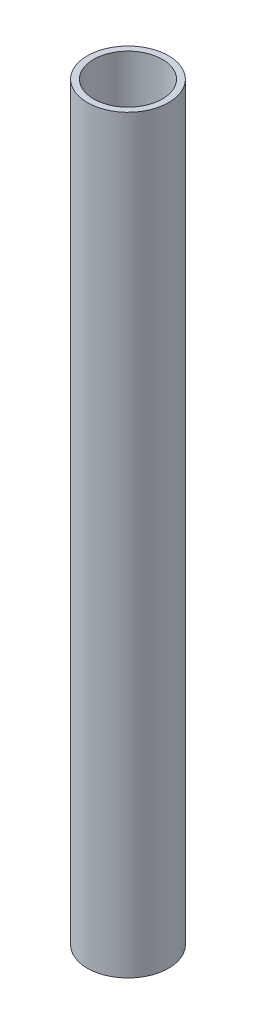
ISO-10303-21;
HEADER;
FILE_DESCRIPTION(('STEP AP214'),'2;1');
FILE_NAME('part.step','',(''),(''),'','','');
FILE_SCHEMA(('AUTOMOTIVE_DESIGN { 1 0 10303 214 1 1 1 1 }'));
ENDSEC;
DATA;
#1=APPLICATION_CONTEXT('core data for automotive mechanical design processes');
#2=APPLICATION_PROTOCOL_DEFINITION('international standard','automotive_design',2000,#1);
#3=PRODUCT_CONTEXT('',#1,'mechanical');
#4=PRODUCT('Part','Part','',(#3));
#5=PRODUCT_RELATED_PRODUCT_CATEGORY('part','',(#4));
#6=PRODUCT_DEFINITION_FORMATION('','',#4);
#7=PRODUCT_DEFINITION_CONTEXT('part definition',#1,'design');
#8=PRODUCT_DEFINITION('design','',#6,#7);
#9=PRODUCT_DEFINITION_SHAPE('','',#8);
#10=(LENGTH_UNIT() NAMED_UNIT(*) SI_UNIT(.MILLI.,.METRE.));
#11=(NAMED_UNIT(*) PLANE_ANGLE_UNIT() SI_UNIT($,.RADIAN.));
#12=(NAMED_UNIT(*) SI_UNIT($,.STERADIAN.) SOLID_ANGLE_UNIT());
#13=UNCERTAINTY_MEASURE_WITH_UNIT(LENGTH_MEASURE(1.E-05),#10,'distance_accuracy_value','');
#14=(GEOMETRIC_REPRESENTATION_CONTEXT(3) GLOBAL_UNCERTAINTY_ASSIGNED_CONTEXT((#13)) GLOBAL_UNIT_ASSIGNED_CONTEXT((#10,
#11,#12)) REPRESENTATION_CONTEXT('',''));
#15=CARTESIAN_POINT('',(0.,0.,0.));
#16=DIRECTION('',(0.,0.,1.));
#17=DIRECTION('',(1.,0.,0.));
#18=AXIS2_PLACEMENT_3D('',#15,#16,#17);
#19=CARTESIAN_POINT('',(0.,120.,0.));
#20=DIRECTION('',(0.,1.,0.));
#21=DIRECTION('',(0.,0.,1.));
#22=AXIS2_PLACEMENT_3D('',#19,#20,#21);
#23=PLANE('',#22);
#24=CARTESIAN_POINT('',(0.,120.,0.));
#25=DIRECTION('',(0.,1.,0.));
#26=DIRECTION('',(0.,0.,1.));
#27=AXIS2_PLACEMENT_3D('',#24,#25,#26);
#28=CIRCLE('',#27,6.5);
#29=CARTESIAN_POINT('',(0.,120.,6.5));
#30=VERTEX_POINT('',#29);
#31=EDGE_CURVE('E10',#30,#30,#28,.T.);
#32=ORIENTED_EDGE('',*,*,#31,.T.);
#33=EDGE_LOOP('',(#32));
#34=FACE_BOUND('',#33,.T.);
#35=CARTESIAN_POINT('',(0.,120.,0.));
#36=DIRECTION('',(0.,1.,0.));
#37=DIRECTION('',(0.,0.,1.));
#38=AXIS2_PLACEMENT_3D('',#35,#36,#37);
#39=CIRCLE('',#38,5.5);
#40=CARTESIAN_POINT('',(0.,120.,5.5));
#41=VERTEX_POINT('',#40);
#42=EDGE_CURVE('E46',#41,#41,#39,.T.);
#43=ORIENTED_EDGE('',*,*,#42,.F.);
#44=EDGE_LOOP('',(#43));
#45=FACE_BOUND('',#44,.T.);
#46=ADVANCED_FACE('F35',(#34,#45),#23,.T.);
#47=CARTESIAN_POINT('',(0.,0.,0.));
#48=DIRECTION('',(0.,1.,0.));
#49=DIRECTION('',(0.,0.,1.));
#50=AXIS2_PLACEMENT_3D('',#47,#48,#49);
#51=PLANE('',#50);
#52=CARTESIAN_POINT('',(0.,0.,0.));
#53=DIRECTION('',(0.,1.,0.));
#54=DIRECTION('',(0.,0.,1.));
#55=AXIS2_PLACEMENT_3D('',#52,#53,#54);
#56=CIRCLE('',#55,6.5);
#57=CARTESIAN_POINT('',(0.,0.,6.5));
#58=VERTEX_POINT('',#57);
#59=EDGE_CURVE('E39',#58,#58,#56,.T.);
#60=ORIENTED_EDGE('',*,*,#59,.F.);
#61=EDGE_LOOP('',(#60));
#62=FACE_BOUND('',#61,.T.);
#63=CARTESIAN_POINT('',(0.,0.,0.));
#64=DIRECTION('',(0.,1.,0.));
#65=DIRECTION('',(0.,0.,1.));
#66=AXIS2_PLACEMENT_3D('',#63,#64,#65);
#67=CIRCLE('',#66,5.5);
#68=CARTESIAN_POINT('',(0.,0.,5.5));
#69=VERTEX_POINT('',#68);
#70=EDGE_CURVE('E48',#69,#69,#67,.T.);
#71=ORIENTED_EDGE('',*,*,#70,.T.);
#72=EDGE_LOOP('',(#71));
#73=FACE_BOUND('',#72,.T.);
#74=ADVANCED_FACE('F58',(#62,#73),#51,.F.);
#75=CARTESIAN_POINT('',(0.,120.,0.));
#76=DIRECTION('',(0.,-1.,0.));
#77=DIRECTION('',(0.,0.,-1.));
#78=AXIS2_PLACEMENT_3D('',#75,#76,#77);
#79=CYLINDRICAL_SURFACE('',#78,6.5);
#80=ORIENTED_EDGE('',*,*,#31,.F.);
#81=EDGE_LOOP('',(#80));
#82=FACE_BOUND('',#81,.T.);
#83=ORIENTED_EDGE('',*,*,#59,.T.);
#84=EDGE_LOOP('',(#83));
#85=FACE_BOUND('',#84,.T.);
#86=ADVANCED_FACE('F37',(#82,#85),#79,.T.);
#87=CARTESIAN_POINT('',(0.,120.,0.));
#88=DIRECTION('',(0.,-1.,0.));
#89=DIRECTION('',(0.,0.,-1.));
#90=AXIS2_PLACEMENT_3D('',#87,#88,#89);
#91=CYLINDRICAL_SURFACE('',#90,5.5);
#92=ORIENTED_EDGE('',*,*,#42,.T.);
#93=EDGE_LOOP('',(#92));
#94=FACE_BOUND('',#93,.T.);
#95=ORIENTED_EDGE('',*,*,#70,.F.);
#96=EDGE_LOOP('',(#95));
#97=FACE_BOUND('',#96,.T.);
#98=ADVANCED_FACE('F54',(#94,#97),#91,.F.);
#99=CLOSED_SHELL('',(#46,#74,#86,#98));
#100=MANIFOLD_SOLID_BREP('B2',#99);
#101=ADVANCED_BREP_SHAPE_REPRESENTATION('',(#18,#100),#14);
#102=SHAPE_DEFINITION_REPRESENTATION(#9,#101);
ENDSEC;
END-ISO-10303-21;
